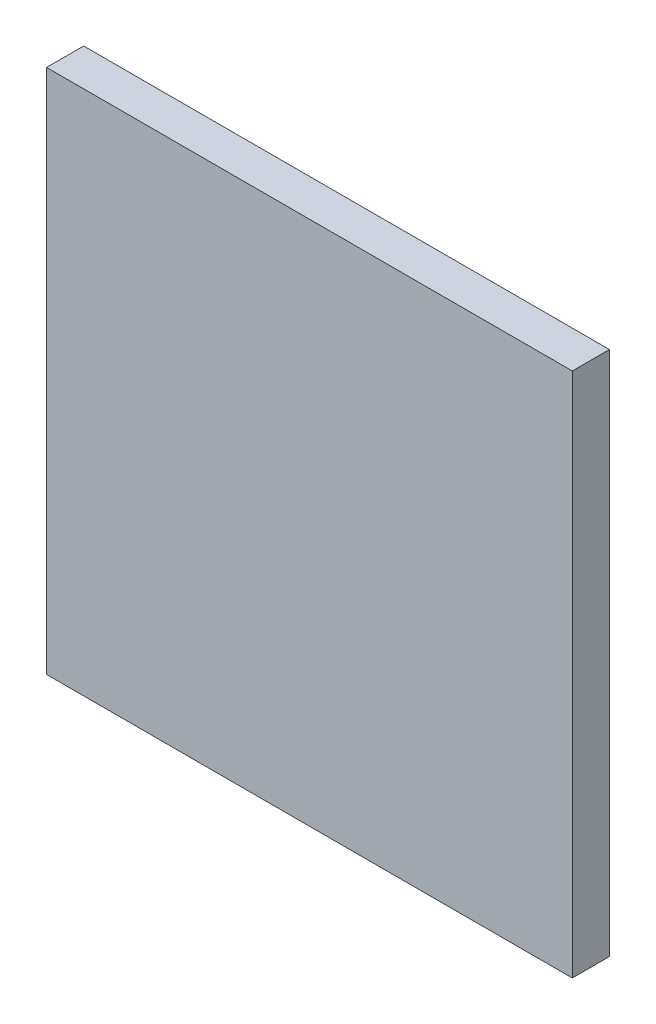
ISO-10303-21;
HEADER;
FILE_DESCRIPTION(('STEP AP214'),'2;1');
FILE_NAME('part.step','',(''),(''),'','','');
FILE_SCHEMA(('AUTOMOTIVE_DESIGN { 1 0 10303 214 1 1 1 1 }'));
ENDSEC;
DATA;
#1=APPLICATION_CONTEXT('core data for automotive mechanical design processes');
#2=APPLICATION_PROTOCOL_DEFINITION('international standard','automotive_design',2000,#1);
#3=PRODUCT_CONTEXT('',#1,'mechanical');
#4=PRODUCT('Part','Part','',(#3));
#5=PRODUCT_RELATED_PRODUCT_CATEGORY('part','',(#4));
#6=PRODUCT_DEFINITION_FORMATION('','',#4);
#7=PRODUCT_DEFINITION_CONTEXT('part definition',#1,'design');
#8=PRODUCT_DEFINITION('design','',#6,#7);
#9=PRODUCT_DEFINITION_SHAPE('','',#8);
#10=(LENGTH_UNIT() NAMED_UNIT(*) SI_UNIT(.MILLI.,.METRE.));
#11=(NAMED_UNIT(*) PLANE_ANGLE_UNIT() SI_UNIT($,.RADIAN.));
#12=(NAMED_UNIT(*) SI_UNIT($,.STERADIAN.) SOLID_ANGLE_UNIT());
#13=UNCERTAINTY_MEASURE_WITH_UNIT(LENGTH_MEASURE(1.E-05),#10,'distance_accuracy_value','');
#14=(GEOMETRIC_REPRESENTATION_CONTEXT(3) GLOBAL_UNCERTAINTY_ASSIGNED_CONTEXT((#13)) GLOBAL_UNIT_ASSIGNED_CONTEXT((#10,
#11,#12)) REPRESENTATION_CONTEXT('',''));
#15=CARTESIAN_POINT('',(0.,0.,0.));
#16=DIRECTION('',(0.,0.,1.));
#17=DIRECTION('',(1.,0.,0.));
#18=AXIS2_PLACEMENT_3D('',#15,#16,#17);
#19=CARTESIAN_POINT('',(-8.5,8.5,1.2));
#20=DIRECTION('',(1.,0.,0.));
#21=DIRECTION('',(0.,0.,-1.));
#22=AXIS2_PLACEMENT_3D('',#19,#20,#21);
#23=PLANE('',#22);
#24=DIRECTION('',(0.,-1.,0.));
#25=VECTOR('',#24,1.);
#26=CARTESIAN_POINT('',(-8.5,8.5,0.));
#27=LINE('',#26,#25);
#28=CARTESIAN_POINT('',(-8.5,8.5,0.));
#29=VERTEX_POINT('',#28);
#30=CARTESIAN_POINT('',(-8.5,-8.5,0.));
#31=VERTEX_POINT('',#30);
#32=EDGE_CURVE('E105',#29,#31,#27,.T.);
#33=ORIENTED_EDGE('',*,*,#32,.T.);
#34=DIRECTION('',(0.,0.,-1.));
#35=VECTOR('',#34,1.);
#36=CARTESIAN_POINT('',(-8.5,-8.5,1.2));
#37=LINE('',#36,#35);
#38=CARTESIAN_POINT('',(-8.5,-8.5,1.2));
#39=VERTEX_POINT('',#38);
#40=EDGE_CURVE('E11',#39,#31,#37,.T.);
#41=ORIENTED_EDGE('',*,*,#40,.F.);
#42=DIRECTION('',(0.,-1.,0.));
#43=VECTOR('',#42,1.);
#44=CARTESIAN_POINT('',(-8.5,8.5,1.2));
#45=LINE('',#44,#43);
#46=CARTESIAN_POINT('',(-8.5,8.5,1.2));
#47=VERTEX_POINT('',#46);
#48=EDGE_CURVE('E89',#47,#39,#45,.T.);
#49=ORIENTED_EDGE('',*,*,#48,.F.);
#50=DIRECTION('',(0.,0.,-1.));
#51=VECTOR('',#50,1.);
#52=CARTESIAN_POINT('',(-8.5,8.5,1.2));
#53=LINE('',#52,#51);
#54=EDGE_CURVE('E97',#47,#29,#53,.T.);
#55=ORIENTED_EDGE('',*,*,#54,.T.);
#56=EDGE_LOOP('',(#33,#41,#49,#55));
#57=FACE_BOUND('',#56,.T.);
#58=ADVANCED_FACE('F39',(#57),#23,.F.);
#59=CARTESIAN_POINT('',(8.5,-8.5,1.2));
#60=DIRECTION('',(0.,1.,0.));
#61=DIRECTION('',(-1.,0.,0.));
#62=AXIS2_PLACEMENT_3D('',#59,#60,#61);
#63=PLANE('',#62);
#64=DIRECTION('',(1.,0.,0.));
#65=VECTOR('',#64,1.);
#66=CARTESIAN_POINT('',(8.5,-8.5,0.));
#67=LINE('',#66,#65);
#68=CARTESIAN_POINT('',(8.5,-8.5,0.));
#69=VERTEX_POINT('',#68);
#70=EDGE_CURVE('E92',#31,#69,#67,.T.);
#71=ORIENTED_EDGE('',*,*,#70,.T.);
#72=DIRECTION('',(0.,0.,-1.));
#73=VECTOR('',#72,1.);
#74=CARTESIAN_POINT('',(8.5,-8.5,1.2));
#75=LINE('',#74,#73);
#76=CARTESIAN_POINT('',(8.5,-8.5,1.2));
#77=VERTEX_POINT('',#76);
#78=EDGE_CURVE('E50',#77,#69,#75,.T.);
#79=ORIENTED_EDGE('',*,*,#78,.F.);
#80=DIRECTION('',(1.,0.,0.));
#81=VECTOR('',#80,1.);
#82=CARTESIAN_POINT('',(8.5,-8.5,1.2));
#83=LINE('',#82,#81);
#84=EDGE_CURVE('E82',#39,#77,#83,.T.);
#85=ORIENTED_EDGE('',*,*,#84,.F.);
#86=ORIENTED_EDGE('',*,*,#40,.T.);
#87=EDGE_LOOP('',(#71,#79,#85,#86));
#88=FACE_BOUND('',#87,.T.);
#89=ADVANCED_FACE('F93',(#88),#63,.F.);
#90=CARTESIAN_POINT('',(8.5,8.5,1.2));
#91=DIRECTION('',(-1.,0.,0.));
#92=DIRECTION('',(0.,-1.,0.));
#93=AXIS2_PLACEMENT_3D('',#90,#91,#92);
#94=PLANE('',#93);
#95=DIRECTION('',(0.,1.,0.));
#96=VECTOR('',#95,1.);
#97=CARTESIAN_POINT('',(8.5,8.5,0.));
#98=LINE('',#97,#96);
#99=CARTESIAN_POINT('',(8.5,8.5,0.));
#100=VERTEX_POINT('',#99);
#101=EDGE_CURVE('E72',#69,#100,#98,.T.);
#102=ORIENTED_EDGE('',*,*,#101,.T.);
#103=DIRECTION('',(0.,0.,-1.));
#104=VECTOR('',#103,1.);
#105=CARTESIAN_POINT('',(8.5,8.5,1.2));
#106=LINE('',#105,#104);
#107=CARTESIAN_POINT('',(8.5,8.5,1.2));
#108=VERTEX_POINT('',#107);
#109=EDGE_CURVE('E94',#108,#100,#106,.T.);
#110=ORIENTED_EDGE('',*,*,#109,.F.);
#111=DIRECTION('',(0.,1.,0.));
#112=VECTOR('',#111,1.);
#113=CARTESIAN_POINT('',(8.5,8.5,1.2));
#114=LINE('',#113,#112);
#115=EDGE_CURVE('E88',#77,#108,#114,.T.);
#116=ORIENTED_EDGE('',*,*,#115,.F.);
#117=ORIENTED_EDGE('',*,*,#78,.T.);
#118=EDGE_LOOP('',(#102,#110,#116,#117));
#119=FACE_BOUND('',#118,.T.);
#120=ADVANCED_FACE('F96',(#119),#94,.F.);
#121=CARTESIAN_POINT('',(8.5,8.5,1.2));
#122=DIRECTION('',(0.,-1.,0.));
#123=DIRECTION('',(1.,0.,0.));
#124=AXIS2_PLACEMENT_3D('',#121,#122,#123);
#125=PLANE('',#124);
#126=DIRECTION('',(-1.,0.,0.));
#127=VECTOR('',#126,1.);
#128=CARTESIAN_POINT('',(8.5,8.5,0.));
#129=LINE('',#128,#127);
#130=EDGE_CURVE('E76',#100,#29,#129,.T.);
#131=ORIENTED_EDGE('',*,*,#130,.T.);
#132=ORIENTED_EDGE('',*,*,#54,.F.);
#133=DIRECTION('',(-1.,0.,0.));
#134=VECTOR('',#133,1.);
#135=CARTESIAN_POINT('',(8.5,8.5,1.2));
#136=LINE('',#135,#134);
#137=EDGE_CURVE('E54',#108,#47,#136,.T.);
#138=ORIENTED_EDGE('',*,*,#137,.F.);
#139=ORIENTED_EDGE('',*,*,#109,.T.);
#140=EDGE_LOOP('',(#131,#132,#138,#139));
#141=FACE_BOUND('',#140,.T.);
#142=ADVANCED_FACE('F108',(#141),#125,.F.);
#143=CARTESIAN_POINT('',(0.,0.,1.2));
#144=DIRECTION('',(0.,0.,-1.));
#145=DIRECTION('',(-1.,0.,0.));
#146=AXIS2_PLACEMENT_3D('',#143,#144,#145);
#147=PLANE('',#146);
#148=ORIENTED_EDGE('',*,*,#48,.T.);
#149=ORIENTED_EDGE('',*,*,#84,.T.);
#150=ORIENTED_EDGE('',*,*,#115,.T.);
#151=ORIENTED_EDGE('',*,*,#137,.T.);
#152=EDGE_LOOP('',(#148,#149,#150,#151));
#153=FACE_BOUND('',#152,.T.);
#154=ADVANCED_FACE('F86',(#153),#147,.F.);
#155=CARTESIAN_POINT('',(0.,0.,0.));
#156=DIRECTION('',(0.,0.,-1.));
#157=DIRECTION('',(-1.,0.,0.));
#158=AXIS2_PLACEMENT_3D('',#155,#156,#157);
#159=PLANE('',#158);
#160=ORIENTED_EDGE('',*,*,#32,.F.);
#161=ORIENTED_EDGE('',*,*,#130,.F.);
#162=ORIENTED_EDGE('',*,*,#101,.F.);
#163=ORIENTED_EDGE('',*,*,#70,.F.);
#164=EDGE_LOOP('',(#160,#161,#162,#163));
#165=FACE_BOUND('',#164,.T.);
#166=ADVANCED_FACE('F115',(#165),#159,.T.);
#167=CLOSED_SHELL('',(#58,#89,#120,#142,#154,#166));
#168=MANIFOLD_SOLID_BREP('B2',#167);
#169=ADVANCED_BREP_SHAPE_REPRESENTATION('',(#18,#168),#14);
#170=SHAPE_DEFINITION_REPRESENTATION(#9,#169);
ENDSEC;
END-ISO-10303-21;
